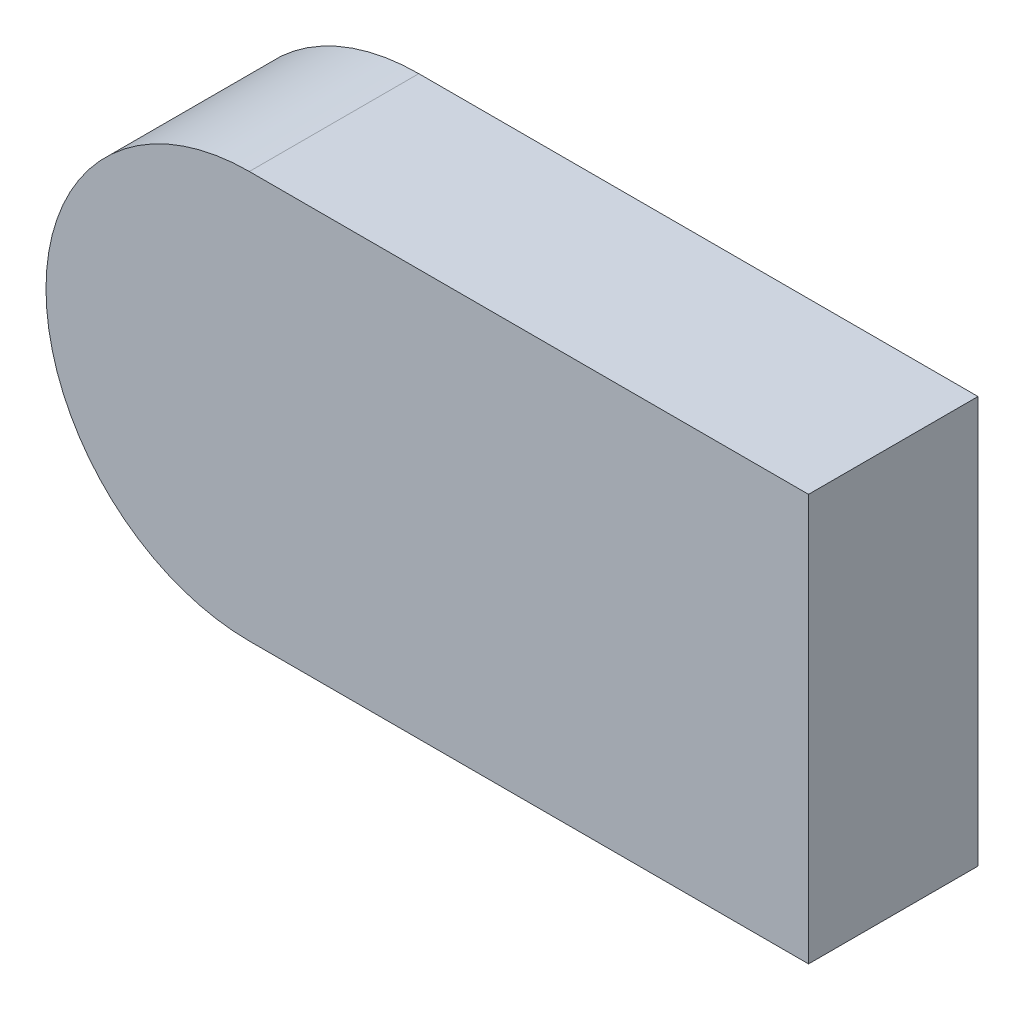
ISO-10303-21;
HEADER;
FILE_DESCRIPTION(('STEP AP214'),'2;1');
FILE_NAME('part.step','',(''),(''),'','','');
FILE_SCHEMA(('AUTOMOTIVE_DESIGN { 1 0 10303 214 1 1 1 1 }'));
ENDSEC;
DATA;
#1=APPLICATION_CONTEXT('core data for automotive mechanical design processes');
#2=APPLICATION_PROTOCOL_DEFINITION('international standard','automotive_design',2000,#1);
#3=PRODUCT_CONTEXT('',#1,'mechanical');
#4=PRODUCT('Part','Part','',(#3));
#5=PRODUCT_RELATED_PRODUCT_CATEGORY('part','',(#4));
#6=PRODUCT_DEFINITION_FORMATION('','',#4);
#7=PRODUCT_DEFINITION_CONTEXT('part definition',#1,'design');
#8=PRODUCT_DEFINITION('design','',#6,#7);
#9=PRODUCT_DEFINITION_SHAPE('','',#8);
#10=(LENGTH_UNIT() NAMED_UNIT(*) SI_UNIT(.MILLI.,.METRE.));
#11=(NAMED_UNIT(*) PLANE_ANGLE_UNIT() SI_UNIT($,.RADIAN.));
#12=(NAMED_UNIT(*) SI_UNIT($,.STERADIAN.) SOLID_ANGLE_UNIT());
#13=UNCERTAINTY_MEASURE_WITH_UNIT(LENGTH_MEASURE(1.E-05),#10,'distance_accuracy_value','');
#14=(GEOMETRIC_REPRESENTATION_CONTEXT(3) GLOBAL_UNCERTAINTY_ASSIGNED_CONTEXT((#13)) GLOBAL_UNIT_ASSIGNED_CONTEXT((#10,
#11,#12)) REPRESENTATION_CONTEXT('',''));
#15=CARTESIAN_POINT('',(0.,0.,0.));
#16=DIRECTION('',(0.,0.,1.));
#17=DIRECTION('',(1.,0.,0.));
#18=AXIS2_PLACEMENT_3D('',#15,#16,#17);
#19=CARTESIAN_POINT('',(4.05,0.63,0.));
#20=DIRECTION('',(0.,-1.,0.));
#21=DIRECTION('',(-1.,0.,0.));
#22=AXIS2_PLACEMENT_3D('',#19,#20,#21);
#23=PLANE('',#22);
#24=DIRECTION('',(0.,0.,1.));
#25=VECTOR('',#24,1.);
#26=CARTESIAN_POINT('',(4.05,0.63,0.));
#27=LINE('',#26,#25);
#28=CARTESIAN_POINT('',(4.05,0.63,0.));
#29=VERTEX_POINT('',#28);
#30=CARTESIAN_POINT('',(4.05,0.63,0.1));
#31=VERTEX_POINT('',#30);
#32=EDGE_CURVE('E11',#29,#31,#27,.T.);
#33=ORIENTED_EDGE('',*,*,#32,.T.);
#34=DIRECTION('',(-1.,0.,0.));
#35=VECTOR('',#34,1.);
#36=CARTESIAN_POINT('',(4.05,0.63,0.1));
#37=LINE('',#36,#35);
#38=CARTESIAN_POINT('',(3.72,0.63,0.1));
#39=VERTEX_POINT('',#38);
#40=EDGE_CURVE('E24',#31,#39,#37,.T.);
#41=ORIENTED_EDGE('',*,*,#40,.T.);
#42=DIRECTION('',(0.,0.,1.));
#43=VECTOR('',#42,1.);
#44=CARTESIAN_POINT('',(3.72,0.63,0.));
#45=LINE('',#44,#43);
#46=CARTESIAN_POINT('',(3.72,0.63,0.));
#47=VERTEX_POINT('',#46);
#48=EDGE_CURVE('E86',#47,#39,#45,.T.);
#49=ORIENTED_EDGE('',*,*,#48,.F.);
#50=DIRECTION('',(-1.,0.,0.));
#51=VECTOR('',#50,1.);
#52=CARTESIAN_POINT('',(4.05,0.63,0.));
#53=LINE('',#52,#51);
#54=EDGE_CURVE('E83',#29,#47,#53,.T.);
#55=ORIENTED_EDGE('',*,*,#54,.F.);
#56=EDGE_LOOP('',(#33,#41,#49,#55));
#57=FACE_BOUND('',#56,.T.);
#58=ADVANCED_FACE('F17',(#57),#23,.T.);
#59=CARTESIAN_POINT('',(3.72,0.75,0.));
#60=DIRECTION('',(0.,0.,-1.));
#61=DIRECTION('',(1.,0.,0.));
#62=AXIS2_PLACEMENT_3D('',#59,#60,#61);
#63=CYLINDRICAL_SURFACE('',#62,0.12);
#64=CARTESIAN_POINT('',(3.72,0.75,0.));
#65=DIRECTION('',(0.,0.,1.));
#66=DIRECTION('',(1.,0.,0.));
#67=AXIS2_PLACEMENT_3D('',#64,#65,#66);
#68=CIRCLE('',#67,0.12);
#69=CARTESIAN_POINT('',(3.72,0.87,0.));
#70=VERTEX_POINT('',#69);
#71=EDGE_CURVE('E80',#70,#47,#68,.T.);
#72=ORIENTED_EDGE('',*,*,#71,.T.);
#73=ORIENTED_EDGE('',*,*,#48,.T.);
#74=CARTESIAN_POINT('',(3.72,0.75,0.1));
#75=DIRECTION('',(0.,0.,1.));
#76=DIRECTION('',(1.,0.,0.));
#77=AXIS2_PLACEMENT_3D('',#74,#75,#76);
#78=CIRCLE('',#77,0.12);
#79=CARTESIAN_POINT('',(3.72,0.87,0.1));
#80=VERTEX_POINT('',#79);
#81=EDGE_CURVE('E78',#80,#39,#78,.T.);
#82=ORIENTED_EDGE('',*,*,#81,.F.);
#83=DIRECTION('',(0.,0.,1.));
#84=VECTOR('',#83,1.);
#85=CARTESIAN_POINT('',(3.72,0.87,0.));
#86=LINE('',#85,#84);
#87=EDGE_CURVE('E67',#70,#80,#86,.T.);
#88=ORIENTED_EDGE('',*,*,#87,.F.);
#89=EDGE_LOOP('',(#72,#73,#82,#88));
#90=FACE_BOUND('',#89,.T.);
#91=ADVANCED_FACE('F89',(#90),#63,.T.);
#92=CARTESIAN_POINT('',(4.05,0.87,0.));
#93=DIRECTION('',(0.,-1.,0.));
#94=DIRECTION('',(-1.,0.,0.));
#95=AXIS2_PLACEMENT_3D('',#92,#93,#94);
#96=PLANE('',#95);
#97=DIRECTION('',(-1.,0.,0.));
#98=VECTOR('',#97,1.);
#99=CARTESIAN_POINT('',(4.05,0.87,0.));
#100=LINE('',#99,#98);
#101=CARTESIAN_POINT('',(4.05,0.87,0.));
#102=VERTEX_POINT('',#101);
#103=EDGE_CURVE('E70',#102,#70,#100,.T.);
#104=ORIENTED_EDGE('',*,*,#103,.T.);
#105=ORIENTED_EDGE('',*,*,#87,.T.);
#106=DIRECTION('',(-1.,0.,0.));
#107=VECTOR('',#106,1.);
#108=CARTESIAN_POINT('',(4.05,0.87,0.1));
#109=LINE('',#108,#107);
#110=CARTESIAN_POINT('',(4.05,0.87,0.1));
#111=VERTEX_POINT('',#110);
#112=EDGE_CURVE('E61',#111,#80,#109,.T.);
#113=ORIENTED_EDGE('',*,*,#112,.F.);
#114=DIRECTION('',(0.,0.,1.));
#115=VECTOR('',#114,1.);
#116=CARTESIAN_POINT('',(4.05,0.87,0.));
#117=LINE('',#116,#115);
#118=EDGE_CURVE('E51',#102,#111,#117,.T.);
#119=ORIENTED_EDGE('',*,*,#118,.F.);
#120=EDGE_LOOP('',(#104,#105,#113,#119));
#121=FACE_BOUND('',#120,.T.);
#122=ADVANCED_FACE('F65',(#121),#96,.F.);
#123=CARTESIAN_POINT('',(4.05,0.63,0.));
#124=DIRECTION('',(-1.,0.,0.));
#125=DIRECTION('',(0.,1.,0.));
#126=AXIS2_PLACEMENT_3D('',#123,#124,#125);
#127=PLANE('',#126);
#128=DIRECTION('',(0.,1.,0.));
#129=VECTOR('',#128,1.);
#130=CARTESIAN_POINT('',(4.05,0.63,0.));
#131=LINE('',#130,#129);
#132=EDGE_CURVE('E57',#29,#102,#131,.T.);
#133=ORIENTED_EDGE('',*,*,#132,.T.);
#134=ORIENTED_EDGE('',*,*,#118,.T.);
#135=DIRECTION('',(0.,1.,0.));
#136=VECTOR('',#135,1.);
#137=CARTESIAN_POINT('',(4.05,0.63,0.1));
#138=LINE('',#137,#136);
#139=EDGE_CURVE('E55',#31,#111,#138,.T.);
#140=ORIENTED_EDGE('',*,*,#139,.F.);
#141=ORIENTED_EDGE('',*,*,#32,.F.);
#142=EDGE_LOOP('',(#133,#134,#140,#141));
#143=FACE_BOUND('',#142,.T.);
#144=ADVANCED_FACE('F53',(#143),#127,.F.);
#145=CARTESIAN_POINT('',(3.849490847913,0.75,0.));
#146=DIRECTION('',(0.,0.,-1.));
#147=DIRECTION('',(-1.,0.,0.));
#148=AXIS2_PLACEMENT_3D('',#145,#146,#147);
#149=PLANE('',#148);
#150=ORIENTED_EDGE('',*,*,#54,.T.);
#151=ORIENTED_EDGE('',*,*,#71,.F.);
#152=ORIENTED_EDGE('',*,*,#103,.F.);
#153=ORIENTED_EDGE('',*,*,#132,.F.);
#154=EDGE_LOOP('',(#150,#151,#152,#153));
#155=FACE_BOUND('',#154,.T.);
#156=ADVANCED_FACE('F91',(#155),#149,.T.);
#157=CARTESIAN_POINT('',(3.849490847913,0.75,0.1));
#158=DIRECTION('',(0.,0.,-1.));
#159=DIRECTION('',(-1.,0.,0.));
#160=AXIS2_PLACEMENT_3D('',#157,#158,#159);
#161=PLANE('',#160);
#162=ORIENTED_EDGE('',*,*,#139,.T.);
#163=ORIENTED_EDGE('',*,*,#112,.T.);
#164=ORIENTED_EDGE('',*,*,#81,.T.);
#165=ORIENTED_EDGE('',*,*,#40,.F.);
#166=EDGE_LOOP('',(#162,#163,#164,#165));
#167=FACE_BOUND('',#166,.T.);
#168=ADVANCED_FACE('F72',(#167),#161,.F.);
#169=CLOSED_SHELL('',(#58,#91,#122,#144,#156,#168));
#170=MANIFOLD_SOLID_BREP('B1',#169);
#171=ADVANCED_BREP_SHAPE_REPRESENTATION('',(#18,#170),#14);
#172=SHAPE_DEFINITION_REPRESENTATION(#9,#171);
ENDSEC;
END-ISO-10303-21;
